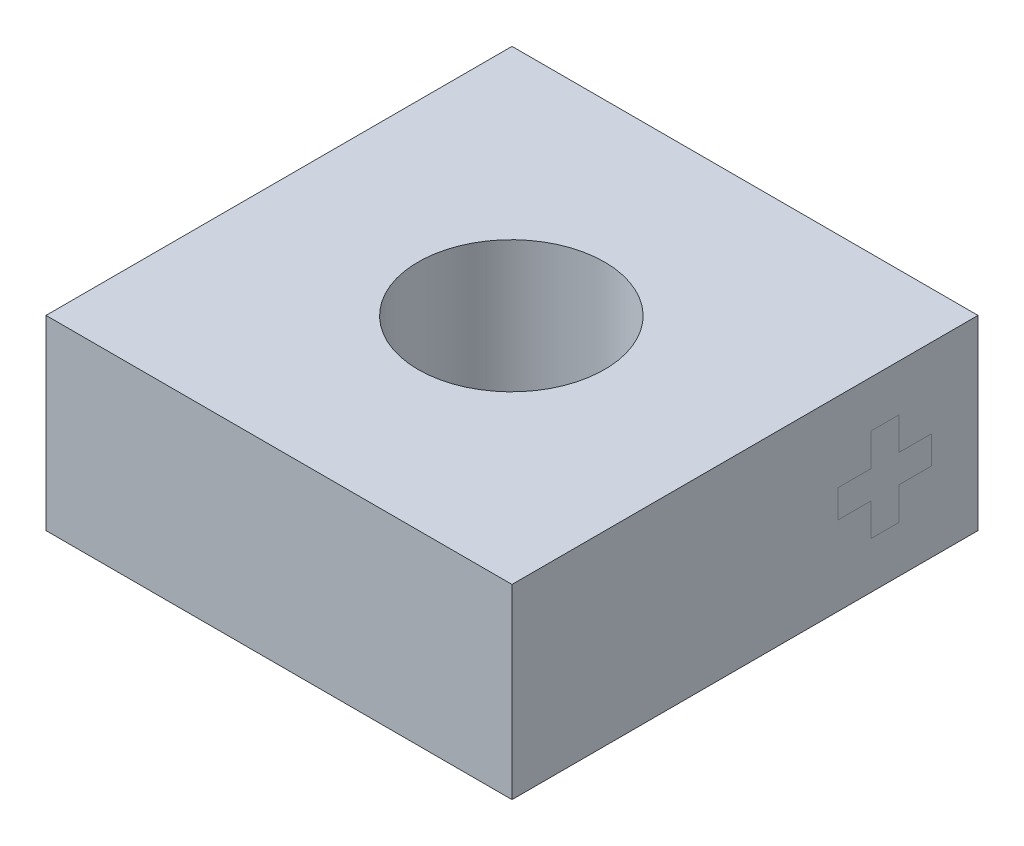
ISO-10303-21;
HEADER;
FILE_DESCRIPTION(('STEP AP214'),'2;1');
FILE_NAME('part.step','',(''),(''),'','','');
FILE_SCHEMA(('AUTOMOTIVE_DESIGN { 1 0 10303 214 1 1 1 1 }'));
ENDSEC;
DATA;
#1=APPLICATION_CONTEXT('core data for automotive mechanical design processes');
#2=APPLICATION_PROTOCOL_DEFINITION('international standard','automotive_design',2000,#1);
#3=PRODUCT_CONTEXT('',#1,'mechanical');
#4=PRODUCT('Part','Part','',(#3));
#5=PRODUCT_RELATED_PRODUCT_CATEGORY('part','',(#4));
#6=PRODUCT_DEFINITION_FORMATION('','',#4);
#7=PRODUCT_DEFINITION_CONTEXT('part definition',#1,'design');
#8=PRODUCT_DEFINITION('design','',#6,#7);
#9=PRODUCT_DEFINITION_SHAPE('','',#8);
#10=(LENGTH_UNIT() NAMED_UNIT(*) SI_UNIT(.MILLI.,.METRE.));
#11=(NAMED_UNIT(*) PLANE_ANGLE_UNIT() SI_UNIT($,.RADIAN.));
#12=(NAMED_UNIT(*) SI_UNIT($,.STERADIAN.) SOLID_ANGLE_UNIT());
#13=UNCERTAINTY_MEASURE_WITH_UNIT(LENGTH_MEASURE(1.E-05),#10,'distance_accuracy_value','');
#14=(GEOMETRIC_REPRESENTATION_CONTEXT(3) GLOBAL_UNCERTAINTY_ASSIGNED_CONTEXT((#13)) GLOBAL_UNIT_ASSIGNED_CONTEXT((#10,
#11,#12)) REPRESENTATION_CONTEXT('',''));
#15=CARTESIAN_POINT('',(0.,0.,0.));
#16=DIRECTION('',(0.,0.,1.));
#17=DIRECTION('',(1.,0.,0.));
#18=AXIS2_PLACEMENT_3D('',#15,#16,#17);
#19=CARTESIAN_POINT('',(2.5,2.,-2.5));
#20=DIRECTION('',(-1.,0.,0.));
#21=DIRECTION('',(0.,0.,1.));
#22=AXIS2_PLACEMENT_3D('',#19,#20,#21);
#23=PLANE('',#22);
#24=DIRECTION('',(0.,0.,-1.));
#25=VECTOR('',#24,1.);
#26=CARTESIAN_POINT('',(2.5,0.5,-1.35));
#27=LINE('',#26,#25);
#28=CARTESIAN_POINT('',(2.5,0.5,-1.35));
#29=VERTEX_POINT('',#28);
#30=CARTESIAN_POINT('',(2.5,0.5,-1.65));
#31=VERTEX_POINT('',#30);
#32=EDGE_CURVE('E357',#29,#31,#27,.T.);
#33=ORIENTED_EDGE('',*,*,#32,.T.);
#34=DIRECTION('',(0.,1.,0.));
#35=VECTOR('',#34,1.);
#36=CARTESIAN_POINT('',(2.5,0.85,-1.65));
#37=LINE('',#36,#35);
#38=CARTESIAN_POINT('',(2.5,0.85,-1.65));
#39=VERTEX_POINT('',#38);
#40=EDGE_CURVE('E13',#31,#39,#37,.T.);
#41=ORIENTED_EDGE('',*,*,#40,.T.);
#42=DIRECTION('',(0.,0.,-1.));
#43=VECTOR('',#42,1.);
#44=CARTESIAN_POINT('',(2.5,0.85,-1.65));
#45=LINE('',#44,#43);
#46=CARTESIAN_POINT('',(2.5,0.85,-2.));
#47=VERTEX_POINT('',#46);
#48=EDGE_CURVE('E445',#39,#47,#45,.T.);
#49=ORIENTED_EDGE('',*,*,#48,.T.);
#50=DIRECTION('',(0.,1.,0.));
#51=VECTOR('',#50,1.);
#52=CARTESIAN_POINT('',(2.5,1.15,-2.));
#53=LINE('',#52,#51);
#54=CARTESIAN_POINT('',(2.5,1.15,-2.));
#55=VERTEX_POINT('',#54);
#56=EDGE_CURVE('E449',#47,#55,#53,.T.);
#57=ORIENTED_EDGE('',*,*,#56,.T.);
#58=DIRECTION('',(0.,0.,1.));
#59=VECTOR('',#58,1.);
#60=CARTESIAN_POINT('',(2.5,1.15,-1.65));
#61=LINE('',#60,#59);
#62=CARTESIAN_POINT('',(2.5,1.15,-1.65));
#63=VERTEX_POINT('',#62);
#64=EDGE_CURVE('E458',#55,#63,#61,.T.);
#65=ORIENTED_EDGE('',*,*,#64,.T.);
#66=DIRECTION('',(0.,1.,0.));
#67=VECTOR('',#66,1.);
#68=CARTESIAN_POINT('',(2.5,1.5,-1.65));
#69=LINE('',#68,#67);
#70=CARTESIAN_POINT('',(2.5,1.5,-1.65));
#71=VERTEX_POINT('',#70);
#72=EDGE_CURVE('E462',#63,#71,#69,.T.);
#73=ORIENTED_EDGE('',*,*,#72,.T.);
#74=DIRECTION('',(0.,0.,1.));
#75=VECTOR('',#74,1.);
#76=CARTESIAN_POINT('',(2.5,1.5,-1.35));
#77=LINE('',#76,#75);
#78=CARTESIAN_POINT('',(2.5,1.5,-1.35));
#79=VERTEX_POINT('',#78);
#80=EDGE_CURVE('E466',#71,#79,#77,.T.);
#81=ORIENTED_EDGE('',*,*,#80,.T.);
#82=DIRECTION('',(0.,-1.,0.));
#83=VECTOR('',#82,1.);
#84=CARTESIAN_POINT('',(2.5,1.5,-1.35));
#85=LINE('',#84,#83);
#86=CARTESIAN_POINT('',(2.5,1.15,-1.35));
#87=VERTEX_POINT('',#86);
#88=EDGE_CURVE('E470',#79,#87,#85,.T.);
#89=ORIENTED_EDGE('',*,*,#88,.T.);
#90=DIRECTION('',(0.,0.,1.));
#91=VECTOR('',#90,1.);
#92=CARTESIAN_POINT('',(2.5,1.15,-1.));
#93=LINE('',#92,#91);
#94=CARTESIAN_POINT('',(2.5,1.15,-1.));
#95=VERTEX_POINT('',#94);
#96=EDGE_CURVE('E474',#87,#95,#93,.T.);
#97=ORIENTED_EDGE('',*,*,#96,.T.);
#98=DIRECTION('',(0.,-1.,0.));
#99=VECTOR('',#98,1.);
#100=CARTESIAN_POINT('',(2.5,1.15,-1.));
#101=LINE('',#100,#99);
#102=CARTESIAN_POINT('',(2.5,0.85,-1.));
#103=VERTEX_POINT('',#102);
#104=EDGE_CURVE('E478',#95,#103,#101,.T.);
#105=ORIENTED_EDGE('',*,*,#104,.T.);
#106=DIRECTION('',(0.,0.,-1.));
#107=VECTOR('',#106,1.);
#108=CARTESIAN_POINT('',(2.5,0.85,-1.));
#109=LINE('',#108,#107);
#110=CARTESIAN_POINT('',(2.5,0.85,-1.35));
#111=VERTEX_POINT('',#110);
#112=EDGE_CURVE('E482',#103,#111,#109,.T.);
#113=ORIENTED_EDGE('',*,*,#112,.T.);
#114=DIRECTION('',(0.,-1.,0.));
#115=VECTOR('',#114,1.);
#116=CARTESIAN_POINT('',(2.5,0.85,-1.35));
#117=LINE('',#116,#115);
#118=EDGE_CURVE('E486',#111,#29,#117,.T.);
#119=ORIENTED_EDGE('',*,*,#118,.T.);
#120=EDGE_LOOP('',(#33,#41,#49,#57,#65,#73,#81,#89,#97,#105,#113,#119));
#121=FACE_BOUND('',#120,.T.);
#122=ADVANCED_FACE('F348',(#121),#23,.F.);
#123=CARTESIAN_POINT('',(-2.5,2.,-2.5));
#124=DIRECTION('',(1.,0.,0.));
#125=DIRECTION('',(0.,0.,-1.));
#126=AXIS2_PLACEMENT_3D('',#123,#124,#125);
#127=PLANE('',#126);
#128=DIRECTION('',(0.,0.,1.));
#129=VECTOR('',#128,1.);
#130=CARTESIAN_POINT('',(-2.5,0.,-2.5));
#131=LINE('',#130,#129);
#132=CARTESIAN_POINT('',(-2.5,0.,-2.5));
#133=VERTEX_POINT('',#132);
#134=CARTESIAN_POINT('',(-2.5,0.,2.5));
#135=VERTEX_POINT('',#134);
#136=EDGE_CURVE('E444',#133,#135,#131,.T.);
#137=ORIENTED_EDGE('',*,*,#136,.T.);
#138=DIRECTION('',(0.,-1.,0.));
#139=VECTOR('',#138,1.);
#140=CARTESIAN_POINT('',(-2.5,2.,2.5));
#141=LINE('',#140,#139);
#142=CARTESIAN_POINT('',(-2.5,2.,2.5));
#143=VERTEX_POINT('',#142);
#144=EDGE_CURVE('E425',#143,#135,#141,.T.);
#145=ORIENTED_EDGE('',*,*,#144,.F.);
#146=DIRECTION('',(0.,0.,1.));
#147=VECTOR('',#146,1.);
#148=CARTESIAN_POINT('',(-2.5,2.,-2.5));
#149=LINE('',#148,#147);
#150=CARTESIAN_POINT('',(-2.5,2.,-2.5));
#151=VERTEX_POINT('',#150);
#152=EDGE_CURVE('E432',#151,#143,#149,.T.);
#153=ORIENTED_EDGE('',*,*,#152,.F.);
#154=DIRECTION('',(0.,-1.,0.));
#155=VECTOR('',#154,1.);
#156=CARTESIAN_POINT('',(-2.5,2.,-2.5));
#157=LINE('',#156,#155);
#158=EDGE_CURVE('E506',#151,#133,#157,.T.);
#159=ORIENTED_EDGE('',*,*,#158,.T.);
#160=EDGE_LOOP('',(#137,#145,#153,#159));
#161=FACE_BOUND('',#160,.T.);
#162=ADVANCED_FACE('F350',(#161),#127,.F.);
#163=CARTESIAN_POINT('',(-2.5,2.,2.5));
#164=DIRECTION('',(0.,0.,-1.));
#165=DIRECTION('',(-1.,0.,0.));
#166=AXIS2_PLACEMENT_3D('',#163,#164,#165);
#167=PLANE('',#166);
#168=DIRECTION('',(1.,0.,0.));
#169=VECTOR('',#168,1.);
#170=CARTESIAN_POINT('',(-2.5,0.,2.5));
#171=LINE('',#170,#169);
#172=CARTESIAN_POINT('',(2.5,0.,2.5));
#173=VERTEX_POINT('',#172);
#174=EDGE_CURVE('E503',#135,#173,#171,.T.);
#175=ORIENTED_EDGE('',*,*,#174,.T.);
#176=DIRECTION('',(0.,-1.,0.));
#177=VECTOR('',#176,1.);
#178=CARTESIAN_POINT('',(2.5,2.,2.5));
#179=LINE('',#178,#177);
#180=CARTESIAN_POINT('',(2.5,2.,2.5));
#181=VERTEX_POINT('',#180);
#182=EDGE_CURVE('E428',#181,#173,#179,.T.);
#183=ORIENTED_EDGE('',*,*,#182,.F.);
#184=DIRECTION('',(1.,0.,0.));
#185=VECTOR('',#184,1.);
#186=CARTESIAN_POINT('',(-2.5,2.,2.5));
#187=LINE('',#186,#185);
#188=EDGE_CURVE('E421',#143,#181,#187,.T.);
#189=ORIENTED_EDGE('',*,*,#188,.F.);
#190=ORIENTED_EDGE('',*,*,#144,.T.);
#191=EDGE_LOOP('',(#175,#183,#189,#190));
#192=FACE_BOUND('',#191,.T.);
#193=ADVANCED_FACE('F423',(#192),#167,.F.);
#194=ORIENTED_EDGE('',*,*,#40,.F.);
#195=ORIENTED_EDGE('',*,*,#32,.F.);
#196=ORIENTED_EDGE('',*,*,#118,.F.);
#197=ORIENTED_EDGE('',*,*,#112,.F.);
#198=ORIENTED_EDGE('',*,*,#104,.F.);
#199=ORIENTED_EDGE('',*,*,#96,.F.);
#200=ORIENTED_EDGE('',*,*,#88,.F.);
#201=ORIENTED_EDGE('',*,*,#80,.F.);
#202=ORIENTED_EDGE('',*,*,#72,.F.);
#203=ORIENTED_EDGE('',*,*,#64,.F.);
#204=ORIENTED_EDGE('',*,*,#56,.F.);
#205=ORIENTED_EDGE('',*,*,#48,.F.);
#206=EDGE_LOOP('',(#194,#195,#196,#197,#198,#199,#200,#201,#202,#203,#204,#205));
#207=FACE_BOUND('',#206,.T.);
#208=DIRECTION('',(0.,0.,-1.));
#209=VECTOR('',#208,1.);
#210=CARTESIAN_POINT('',(2.5,0.,-2.5));
#211=LINE('',#210,#209);
#212=CARTESIAN_POINT('',(2.5,0.,-2.5));
#213=VERTEX_POINT('',#212);
#214=EDGE_CURVE('E499',#173,#213,#211,.T.);
#215=ORIENTED_EDGE('',*,*,#214,.T.);
#216=DIRECTION('',(0.,-1.,0.));
#217=VECTOR('',#216,1.);
#218=CARTESIAN_POINT('',(2.5,2.,-2.5));
#219=LINE('',#218,#217);
#220=CARTESIAN_POINT('',(2.5,2.,-2.5));
#221=VERTEX_POINT('',#220);
#222=EDGE_CURVE('E451',#221,#213,#219,.T.);
#223=ORIENTED_EDGE('',*,*,#222,.F.);
#224=DIRECTION('',(0.,0.,-1.));
#225=VECTOR('',#224,1.);
#226=CARTESIAN_POINT('',(2.5,2.,-2.5));
#227=LINE('',#226,#225);
#228=EDGE_CURVE('E431',#181,#221,#227,.T.);
#229=ORIENTED_EDGE('',*,*,#228,.F.);
#230=ORIENTED_EDGE('',*,*,#182,.T.);
#231=EDGE_LOOP('',(#215,#223,#229,#230));
#232=FACE_BOUND('',#231,.T.);
#233=ADVANCED_FACE('F492',(#207,#232),#23,.F.);
#234=CARTESIAN_POINT('',(-2.5,2.,-2.5));
#235=DIRECTION('',(0.,0.,1.));
#236=DIRECTION('',(1.,0.,0.));
#237=AXIS2_PLACEMENT_3D('',#234,#235,#236);
#238=PLANE('',#237);
#239=DIRECTION('',(-1.,0.,0.));
#240=VECTOR('',#239,1.);
#241=CARTESIAN_POINT('',(-2.5,0.,-2.5));
#242=LINE('',#241,#240);
#243=EDGE_CURVE('E441',#213,#133,#242,.T.);
#244=ORIENTED_EDGE('',*,*,#243,.T.);
#245=ORIENTED_EDGE('',*,*,#158,.F.);
#246=DIRECTION('',(-1.,0.,0.));
#247=VECTOR('',#246,1.);
#248=CARTESIAN_POINT('',(-2.5,2.,-2.5));
#249=LINE('',#248,#247);
#250=EDGE_CURVE('E437',#221,#151,#249,.T.);
#251=ORIENTED_EDGE('',*,*,#250,.F.);
#252=ORIENTED_EDGE('',*,*,#222,.T.);
#253=EDGE_LOOP('',(#244,#245,#251,#252));
#254=FACE_BOUND('',#253,.T.);
#255=ADVANCED_FACE('F495',(#254),#238,.F.);
#256=CARTESIAN_POINT('',(0.,2.,0.));
#257=DIRECTION('',(0.,1.,0.));
#258=DIRECTION('',(0.,0.,1.));
#259=AXIS2_PLACEMENT_3D('',#256,#257,#258);
#260=PLANE('',#259);
#261=CARTESIAN_POINT('',(0.,2.,0.0071348323018583));
#262=DIRECTION('',(0.,1.,0.));
#263=DIRECTION('',(0.,0.,1.));
#264=AXIS2_PLACEMENT_3D('',#261,#262,#263);
#265=CIRCLE('',#264,1.);
#266=CARTESIAN_POINT('',(0.,2.,1.00713483230186));
#267=VERTEX_POINT('',#266);
#268=EDGE_CURVE('E516',#267,#267,#265,.T.);
#269=ORIENTED_EDGE('',*,*,#268,.F.);
#270=EDGE_LOOP('',(#269));
#271=FACE_BOUND('',#270,.T.);
#272=ORIENTED_EDGE('',*,*,#152,.T.);
#273=ORIENTED_EDGE('',*,*,#188,.T.);
#274=ORIENTED_EDGE('',*,*,#228,.T.);
#275=ORIENTED_EDGE('',*,*,#250,.T.);
#276=EDGE_LOOP('',(#272,#273,#274,#275));
#277=FACE_BOUND('',#276,.T.);
#278=ADVANCED_FACE('F435',(#271,#277),#260,.T.);
#279=CARTESIAN_POINT('',(0.,0.,0.));
#280=DIRECTION('',(0.,1.,0.));
#281=DIRECTION('',(0.,0.,1.));
#282=AXIS2_PLACEMENT_3D('',#279,#280,#281);
#283=PLANE('',#282);
#284=CARTESIAN_POINT('',(0.,0.,0.0071348323018583));
#285=DIRECTION('',(0.,1.,0.));
#286=DIRECTION('',(0.,0.,1.));
#287=AXIS2_PLACEMENT_3D('',#284,#285,#286);
#288=CIRCLE('',#287,1.);
#289=CARTESIAN_POINT('',(0.,0.,1.00713483230186));
#290=VERTEX_POINT('',#289);
#291=EDGE_CURVE('E514',#290,#290,#288,.T.);
#292=ORIENTED_EDGE('',*,*,#291,.T.);
#293=EDGE_LOOP('',(#292));
#294=FACE_BOUND('',#293,.T.);
#295=ORIENTED_EDGE('',*,*,#136,.F.);
#296=ORIENTED_EDGE('',*,*,#243,.F.);
#297=ORIENTED_EDGE('',*,*,#214,.F.);
#298=ORIENTED_EDGE('',*,*,#174,.F.);
#299=EDGE_LOOP('',(#295,#296,#297,#298));
#300=FACE_BOUND('',#299,.T.);
#301=ADVANCED_FACE('F507',(#294,#300),#283,.F.);
#302=CARTESIAN_POINT('',(0.,0.,0.0071348323018583));
#303=DIRECTION('',(0.,1.,0.));
#304=DIRECTION('',(0.,0.,1.));
#305=AXIS2_PLACEMENT_3D('',#302,#303,#304);
#306=CYLINDRICAL_SURFACE('',#305,1.);
#307=ORIENTED_EDGE('',*,*,#291,.F.);
#308=EDGE_LOOP('',(#307));
#309=FACE_BOUND('',#308,.T.);
#310=ORIENTED_EDGE('',*,*,#268,.T.);
#311=EDGE_LOOP('',(#310));
#312=FACE_BOUND('',#311,.T.);
#313=ADVANCED_FACE('F524',(#309,#312),#306,.F.);
#314=CLOSED_SHELL('',(#122,#162,#193,#233,#255,#278,#301,#313));
#315=MANIFOLD_SOLID_BREP('B2',#314);
#316=ADVANCED_BREP_SHAPE_REPRESENTATION('',(#18,#315),#14);
#317=SHAPE_DEFINITION_REPRESENTATION(#9,#316);
ENDSEC;
END-ISO-10303-21;
